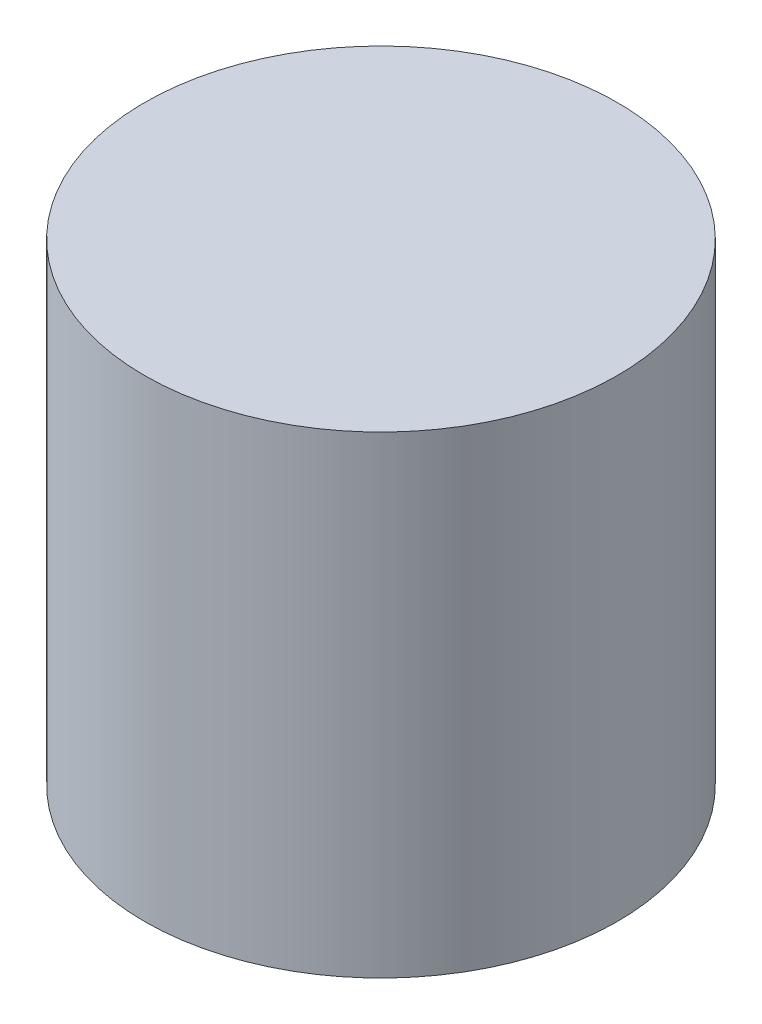
ISO-10303-21;
HEADER;
FILE_DESCRIPTION(('STEP AP214'),'2;1');
FILE_NAME('part.step','',(''),(''),'','','');
FILE_SCHEMA(('AUTOMOTIVE_DESIGN { 1 0 10303 214 1 1 1 1 }'));
ENDSEC;
DATA;
#1=APPLICATION_CONTEXT('core data for automotive mechanical design processes');
#2=APPLICATION_PROTOCOL_DEFINITION('international standard','automotive_design',2000,#1);
#3=PRODUCT_CONTEXT('',#1,'mechanical');
#4=PRODUCT('Part','Part','',(#3));
#5=PRODUCT_RELATED_PRODUCT_CATEGORY('part','',(#4));
#6=PRODUCT_DEFINITION_FORMATION('','',#4);
#7=PRODUCT_DEFINITION_CONTEXT('part definition',#1,'design');
#8=PRODUCT_DEFINITION('design','',#6,#7);
#9=PRODUCT_DEFINITION_SHAPE('','',#8);
#10=(LENGTH_UNIT() NAMED_UNIT(*) SI_UNIT(.MILLI.,.METRE.));
#11=(NAMED_UNIT(*) PLANE_ANGLE_UNIT() SI_UNIT($,.RADIAN.));
#12=(NAMED_UNIT(*) SI_UNIT($,.STERADIAN.) SOLID_ANGLE_UNIT());
#13=UNCERTAINTY_MEASURE_WITH_UNIT(LENGTH_MEASURE(1.E-05),#10,'distance_accuracy_value','');
#14=(GEOMETRIC_REPRESENTATION_CONTEXT(3) GLOBAL_UNCERTAINTY_ASSIGNED_CONTEXT((#13)) GLOBAL_UNIT_ASSIGNED_CONTEXT((#10,
#11,#12)) REPRESENTATION_CONTEXT('',''));
#15=CARTESIAN_POINT('',(0.,0.,0.));
#16=DIRECTION('',(0.,0.,1.));
#17=DIRECTION('',(1.,0.,0.));
#18=AXIS2_PLACEMENT_3D('',#15,#16,#17);
#19=CARTESIAN_POINT('',(250.,212.132034355964,-500.));
#20=DIRECTION('',(0.,-1.,0.));
#21=DIRECTION('',(0.,0.,-1.));
#22=AXIS2_PLACEMENT_3D('',#19,#20,#21);
#23=CYLINDRICAL_SURFACE('',#22,75.0000000000001);
#24=CARTESIAN_POINT('',(250.,-150.,-500.));
#25=DIRECTION('',(0.,1.,0.));
#26=DIRECTION('',(0.,0.,1.));
#27=AXIS2_PLACEMENT_3D('',#24,#25,#26);
#28=CIRCLE('',#27,75.0000000000001);
#29=CARTESIAN_POINT('',(250.,-150.,-425.));
#30=VERTEX_POINT('',#29);
#31=EDGE_CURVE('E38',#30,#30,#28,.T.);
#32=ORIENTED_EDGE('',*,*,#31,.T.);
#33=EDGE_LOOP('',(#32));
#34=FACE_BOUND('',#33,.T.);
#35=CARTESIAN_POINT('',(250.,0.,-500.));
#36=DIRECTION('',(0.,1.,0.));
#37=DIRECTION('',(0.,0.,1.));
#38=AXIS2_PLACEMENT_3D('',#35,#36,#37);
#39=CIRCLE('',#38,75.0000000000001);
#40=CARTESIAN_POINT('',(250.,0.,-425.));
#41=VERTEX_POINT('',#40);
#42=EDGE_CURVE('E10',#41,#41,#39,.T.);
#43=ORIENTED_EDGE('',*,*,#42,.F.);
#44=EDGE_LOOP('',(#43));
#45=FACE_BOUND('',#44,.T.);
#46=ADVANCED_FACE('F31',(#34,#45),#23,.T.);
#47=CARTESIAN_POINT('',(250.,-150.,-500.));
#48=DIRECTION('',(0.,1.,0.));
#49=DIRECTION('',(0.,0.,1.));
#50=AXIS2_PLACEMENT_3D('',#47,#48,#49);
#51=PLANE('',#50);
#52=ORIENTED_EDGE('',*,*,#31,.F.);
#53=EDGE_LOOP('',(#52));
#54=FACE_BOUND('',#53,.T.);
#55=ADVANCED_FACE('F46',(#54),#51,.F.);
#56=CARTESIAN_POINT('',(0.,0.,0.));
#57=DIRECTION('',(0.,1.,0.));
#58=DIRECTION('',(0.,0.,1.));
#59=AXIS2_PLACEMENT_3D('',#56,#57,#58);
#60=PLANE('',#59);
#61=ORIENTED_EDGE('',*,*,#42,.T.);
#62=EDGE_LOOP('',(#61));
#63=FACE_BOUND('',#62,.T.);
#64=ADVANCED_FACE('F33',(#63),#60,.T.);
#65=CLOSED_SHELL('',(#46,#55,#64));
#66=MANIFOLD_SOLID_BREP('B2',#65);
#67=ADVANCED_BREP_SHAPE_REPRESENTATION('',(#18,#66),#14);
#68=SHAPE_DEFINITION_REPRESENTATION(#9,#67);
ENDSEC;
END-ISO-10303-21;
